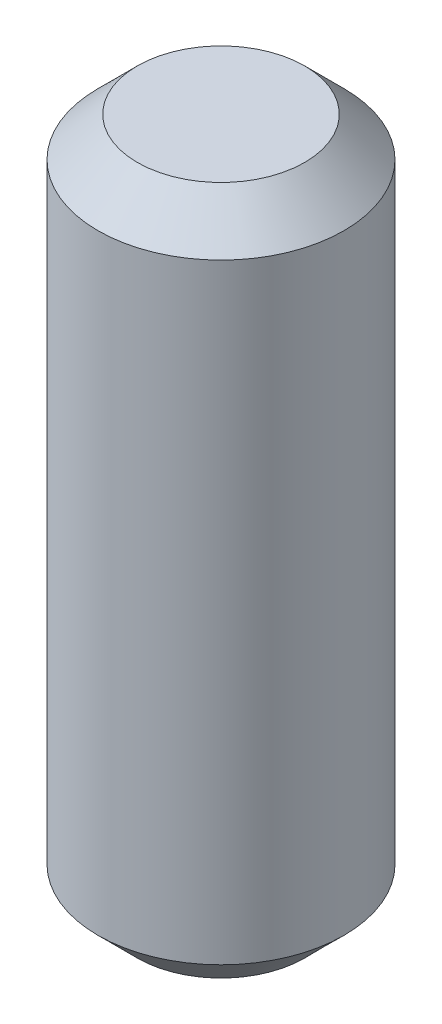
ISO-10303-21;
HEADER;
FILE_DESCRIPTION(('STEP AP214'),'2;1');
FILE_NAME('part.step','',(''),(''),'','','');
FILE_SCHEMA(('AUTOMOTIVE_DESIGN { 1 0 10303 214 1 1 1 1 }'));
ENDSEC;
DATA;
#1=APPLICATION_CONTEXT('core data for automotive mechanical design processes');
#2=APPLICATION_PROTOCOL_DEFINITION('international standard','automotive_design',2000,#1);
#3=PRODUCT_CONTEXT('',#1,'mechanical');
#4=PRODUCT('Part','Part','',(#3));
#5=PRODUCT_RELATED_PRODUCT_CATEGORY('part','',(#4));
#6=PRODUCT_DEFINITION_FORMATION('','',#4);
#7=PRODUCT_DEFINITION_CONTEXT('part definition',#1,'design');
#8=PRODUCT_DEFINITION('design','',#6,#7);
#9=PRODUCT_DEFINITION_SHAPE('','',#8);
#10=(LENGTH_UNIT() NAMED_UNIT(*) SI_UNIT(.MILLI.,.METRE.));
#11=(NAMED_UNIT(*) PLANE_ANGLE_UNIT() SI_UNIT($,.RADIAN.));
#12=(NAMED_UNIT(*) SI_UNIT($,.STERADIAN.) SOLID_ANGLE_UNIT());
#13=UNCERTAINTY_MEASURE_WITH_UNIT(LENGTH_MEASURE(1.E-05),#10,'distance_accuracy_value','');
#14=(GEOMETRIC_REPRESENTATION_CONTEXT(3) GLOBAL_UNCERTAINTY_ASSIGNED_CONTEXT((#13)) GLOBAL_UNIT_ASSIGNED_CONTEXT((#10,
#11,#12)) REPRESENTATION_CONTEXT('',''));
#15=CARTESIAN_POINT('',(0.,0.,0.));
#16=DIRECTION('',(0.,0.,1.));
#17=DIRECTION('',(1.,0.,0.));
#18=AXIS2_PLACEMENT_3D('',#15,#16,#17);
#19=CARTESIAN_POINT('',(0.,-14.,0.));
#20=DIRECTION('',(0.,1.,0.));
#21=DIRECTION('',(0.,0.,1.));
#22=AXIS2_PLACEMENT_3D('',#19,#20,#21);
#23=PLANE('',#22);
#24=CARTESIAN_POINT('',(0.,-14.00000000001,0.));
#25=DIRECTION('',(0.,1.,0.));
#26=DIRECTION('',(-1.,0.,0.));
#27=AXIS2_PLACEMENT_3D('',#24,#25,#26);
#28=CIRCLE('',#27,1.70000000002801);
#29=CARTESIAN_POINT('',(-1.70000000002801,-14.00000000001,0.));
#30=VERTEX_POINT('',#29);
#31=EDGE_CURVE('E18',#30,#30,#28,.T.);
#32=ORIENTED_EDGE('',*,*,#31,.F.);
#33=EDGE_LOOP('',(#32));
#34=FACE_BOUND('',#33,.T.);
#35=ADVANCED_FACE('F15',(#34),#23,.F.);
#36=CARTESIAN_POINT('',(0.,0.,0.));
#37=DIRECTION('',(0.,1.,0.));
#38=DIRECTION('',(0.,0.,1.));
#39=AXIS2_PLACEMENT_3D('',#36,#37,#38);
#40=PLANE('',#39);
#41=CARTESIAN_POINT('',(0.,1.13686837721616E-10,0.));
#42=DIRECTION('',(0.,-1.,0.));
#43=DIRECTION('',(0.,0.,-1.));
#44=AXIS2_PLACEMENT_3D('',#41,#42,#43);
#45=CIRCLE('',#44,1.70000000002801);
#46=CARTESIAN_POINT('',(0.,1.13686837721616E-10,-1.70000000002801));
#47=VERTEX_POINT('',#46);
#48=EDGE_CURVE('E27',#47,#47,#45,.T.);
#49=ORIENTED_EDGE('',*,*,#48,.F.);
#50=EDGE_LOOP('',(#49));
#51=FACE_BOUND('',#50,.T.);
#52=ADVANCED_FACE('F39',(#51),#40,.T.);
#53=CARTESIAN_POINT('',(0.,-13.2000000000403,0.));
#54=DIRECTION('',(0.,1.,0.));
#55=DIRECTION('',(-1.,0.,0.));
#56=AXIS2_PLACEMENT_3D('',#53,#54,#55);
#57=CONICAL_SURFACE('',#56,2.49999999999773,0.785398163397448);
#58=ORIENTED_EDGE('',*,*,#31,.T.);
#59=EDGE_LOOP('',(#58));
#60=FACE_BOUND('',#59,.T.);
#61=CARTESIAN_POINT('',(0.,-13.2,0.));
#62=DIRECTION('',(0.,1.,0.));
#63=DIRECTION('',(0.,0.,1.));
#64=AXIS2_PLACEMENT_3D('',#61,#62,#63);
#65=CIRCLE('',#64,2.5);
#66=CARTESIAN_POINT('',(0.,-13.2,2.5));
#67=VERTEX_POINT('',#66);
#68=EDGE_CURVE('E22',#67,#67,#65,.T.);
#69=ORIENTED_EDGE('',*,*,#68,.F.);
#70=EDGE_LOOP('',(#69));
#71=FACE_BOUND('',#70,.T.);
#72=ADVANCED_FACE('F35',(#60,#71),#57,.T.);
#73=CARTESIAN_POINT('',(0.,-0.799999999856027,0.));
#74=DIRECTION('',(0.,-1.,0.));
#75=DIRECTION('',(0.,0.,-1.));
#76=AXIS2_PLACEMENT_3D('',#73,#74,#75);
#77=CONICAL_SURFACE('',#76,2.49999999999773,0.785398163397448);
#78=CARTESIAN_POINT('',(0.,-0.8,0.));
#79=DIRECTION('',(0.,1.,0.));
#80=DIRECTION('',(0.,0.,1.));
#81=AXIS2_PLACEMENT_3D('',#78,#79,#80);
#82=CIRCLE('',#81,2.5);
#83=CARTESIAN_POINT('',(0.,-0.8,2.5));
#84=VERTEX_POINT('',#83);
#85=EDGE_CURVE('E10',#84,#84,#82,.F.);
#86=ORIENTED_EDGE('',*,*,#85,.F.);
#87=EDGE_LOOP('',(#86));
#88=FACE_BOUND('',#87,.T.);
#89=ORIENTED_EDGE('',*,*,#48,.T.);
#90=EDGE_LOOP('',(#89));
#91=FACE_BOUND('',#90,.T.);
#92=ADVANCED_FACE('F47',(#88,#91),#77,.T.);
#93=CARTESIAN_POINT('',(0.,-14.7,0.));
#94=DIRECTION('',(0.,1.,0.));
#95=DIRECTION('',(0.,0.,1.));
#96=AXIS2_PLACEMENT_3D('',#93,#94,#95);
#97=CYLINDRICAL_SURFACE('',#96,2.5);
#98=ORIENTED_EDGE('',*,*,#85,.T.);
#99=EDGE_LOOP('',(#98));
#100=FACE_BOUND('',#99,.T.);
#101=ORIENTED_EDGE('',*,*,#68,.T.);
#102=EDGE_LOOP('',(#101));
#103=FACE_BOUND('',#102,.T.);
#104=ADVANCED_FACE('F45',(#100,#103),#97,.T.);
#105=CLOSED_SHELL('',(#35,#52,#72,#92,#104));
#106=MANIFOLD_SOLID_BREP('B1',#105);
#107=ADVANCED_BREP_SHAPE_REPRESENTATION('',(#18,#106),#14);
#108=SHAPE_DEFINITION_REPRESENTATION(#9,#107);
ENDSEC;
END-ISO-10303-21;
